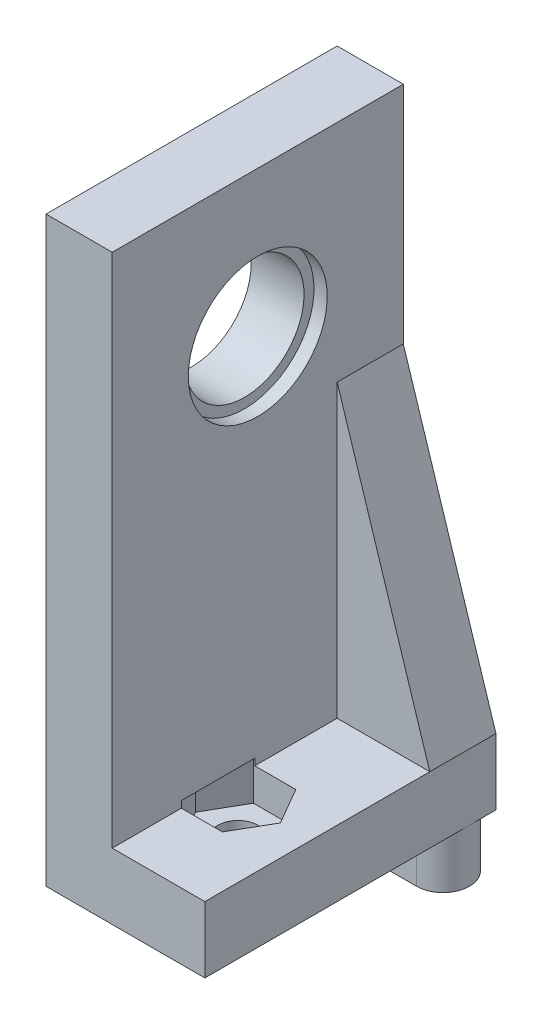
ISO-10303-21;
HEADER;
FILE_DESCRIPTION(('STEP AP214'),'2;1');
FILE_NAME('part.step','',(''),(''),'','','');
FILE_SCHEMA(('AUTOMOTIVE_DESIGN { 1 0 10303 214 1 1 1 1 }'));
ENDSEC;
DATA;
#1=APPLICATION_CONTEXT('core data for automotive mechanical design processes');
#2=APPLICATION_PROTOCOL_DEFINITION('international standard','automotive_design',2000,#1);
#3=PRODUCT_CONTEXT('',#1,'mechanical');
#4=PRODUCT('Part','Part','',(#3));
#5=PRODUCT_RELATED_PRODUCT_CATEGORY('part','',(#4));
#6=PRODUCT_DEFINITION_FORMATION('','',#4);
#7=PRODUCT_DEFINITION_CONTEXT('part definition',#1,'design');
#8=PRODUCT_DEFINITION('design','',#6,#7);
#9=PRODUCT_DEFINITION_SHAPE('','',#8);
#10=(LENGTH_UNIT() NAMED_UNIT(*) SI_UNIT(.MILLI.,.METRE.));
#11=(NAMED_UNIT(*) PLANE_ANGLE_UNIT() SI_UNIT($,.RADIAN.));
#12=(NAMED_UNIT(*) SI_UNIT($,.STERADIAN.) SOLID_ANGLE_UNIT());
#13=UNCERTAINTY_MEASURE_WITH_UNIT(LENGTH_MEASURE(1.E-05),#10,'distance_accuracy_value','');
#14=(GEOMETRIC_REPRESENTATION_CONTEXT(3) GLOBAL_UNCERTAINTY_ASSIGNED_CONTEXT((#13)) GLOBAL_UNIT_ASSIGNED_CONTEXT((#10,
#11,#12)) REPRESENTATION_CONTEXT('',''));
#15=CARTESIAN_POINT('',(0.,0.,0.));
#16=DIRECTION('',(0.,0.,1.));
#17=DIRECTION('',(1.,0.,0.));
#18=AXIS2_PLACEMENT_3D('',#15,#16,#17);
#19=CARTESIAN_POINT('',(5.,-27.,11.));
#20=DIRECTION('',(1.,0.,0.));
#21=DIRECTION('',(0.,0.,-1.));
#22=AXIS2_PLACEMENT_3D('',#19,#20,#21);
#23=PLANE('',#22);
#24=DIRECTION('',(0.,0.,-1.));
#25=VECTOR('',#24,1.);
#26=CARTESIAN_POINT('',(5.,0.,-24.));
#27=LINE('',#26,#25);
#28=CARTESIAN_POINT('',(5.,0.,-24.));
#29=VERTEX_POINT('',#28);
#30=CARTESIAN_POINT('',(5.,0.,-29.));
#31=VERTEX_POINT('',#30);
#32=EDGE_CURVE('E166',#29,#31,#27,.T.);
#33=ORIENTED_EDGE('',*,*,#32,.T.);
#34=DIRECTION('',(0.,1.,0.));
#35=VECTOR('',#34,1.);
#36=CARTESIAN_POINT('',(5.,17.,-29.));
#37=LINE('',#36,#35);
#38=CARTESIAN_POINT('',(5.,17.,-29.));
#39=VERTEX_POINT('',#38);
#40=EDGE_CURVE('E309',#31,#39,#37,.T.);
#41=ORIENTED_EDGE('',*,*,#40,.T.);
#42=DIRECTION('',(0.,0.,1.));
#43=VECTOR('',#42,1.);
#44=CARTESIAN_POINT('',(5.,17.,11.));
#45=LINE('',#44,#43);
#46=CARTESIAN_POINT('',(5.,17.,-7.));
#47=VERTEX_POINT('',#46);
#48=EDGE_CURVE('E305',#39,#47,#45,.T.);
#49=ORIENTED_EDGE('',*,*,#48,.T.);
#50=DIRECTION('',(0.,1.,0.));
#51=VECTOR('',#50,1.);
#52=CARTESIAN_POINT('',(5.,17.,-7.));
#53=LINE('',#52,#51);
#54=CARTESIAN_POINT('',(5.,-22.,-7.00000000000001));
#55=VERTEX_POINT('',#54);
#56=EDGE_CURVE('E285',#55,#47,#53,.T.);
#57=ORIENTED_EDGE('',*,*,#56,.F.);
#58=DIRECTION('',(0.,0.,1.));
#59=VECTOR('',#58,1.);
#60=CARTESIAN_POINT('',(5.,-22.,-7.00000000000001));
#61=LINE('',#60,#59);
#62=CARTESIAN_POINT('',(5.,-22.,-12.225));
#63=VERTEX_POINT('',#62);
#64=EDGE_CURVE('E261',#63,#55,#61,.T.);
#65=ORIENTED_EDGE('',*,*,#64,.F.);
#66=DIRECTION('',(0.,1.,0.));
#67=VECTOR('',#66,1.);
#68=CARTESIAN_POINT('',(5.,-27.,-12.225));
#69=LINE('',#68,#67);
#70=CARTESIAN_POINT('',(5.,-21.5,-12.225));
#71=VERTEX_POINT('',#70);
#72=EDGE_CURVE('E58',#63,#71,#69,.T.);
#73=ORIENTED_EDGE('',*,*,#72,.T.);
#74=DIRECTION('',(0.,0.,1.));
#75=VECTOR('',#74,1.);
#76=CARTESIAN_POINT('',(5.,-21.5,11.));
#77=LINE('',#76,#75);
#78=CARTESIAN_POINT('',(5.,-21.5,-17.775));
#79=VERTEX_POINT('',#78);
#80=EDGE_CURVE('E11',#79,#71,#77,.T.);
#81=ORIENTED_EDGE('',*,*,#80,.F.);
#82=DIRECTION('',(0.,-1.,0.));
#83=VECTOR('',#82,1.);
#84=CARTESIAN_POINT('',(5.,-27.,-17.775));
#85=LINE('',#84,#83);
#86=CARTESIAN_POINT('',(5.,-22.,-17.775));
#87=VERTEX_POINT('',#86);
#88=EDGE_CURVE('E226',#79,#87,#85,.T.);
#89=ORIENTED_EDGE('',*,*,#88,.T.);
#90=CARTESIAN_POINT('',(5.,-22.,-24.));
#91=VERTEX_POINT('',#90);
#92=EDGE_CURVE('E36',#91,#87,#61,.T.);
#93=ORIENTED_EDGE('',*,*,#92,.F.);
#94=DIRECTION('',(0.,1.,0.));
#95=VECTOR('',#94,1.);
#96=CARTESIAN_POINT('',(5.,0.,-24.));
#97=LINE('',#96,#95);
#98=EDGE_CURVE('E178',#91,#29,#97,.T.);
#99=ORIENTED_EDGE('',*,*,#98,.T.);
#100=EDGE_LOOP('',(#33,#41,#49,#57,#65,#73,#81,#89,#93,#99));
#101=FACE_BOUND('',#100,.T.);
#102=CARTESIAN_POINT('',(5.,6.,-18.));
#103=DIRECTION('',(-1.,0.,0.));
#104=DIRECTION('',(0.,0.,1.));
#105=AXIS2_PLACEMENT_3D('',#102,#103,#104);
#106=CIRCLE('',#105,5.25);
#107=CARTESIAN_POINT('',(5.,6.,-12.75));
#108=VERTEX_POINT('',#107);
#109=EDGE_CURVE('E388',#108,#108,#106,.T.);
#110=ORIENTED_EDGE('',*,*,#109,.T.);
#111=EDGE_LOOP('',(#110));
#112=FACE_BOUND('',#111,.T.);
#113=ADVANCED_FACE('F32',(#101,#112),#23,.T.);
#114=CARTESIAN_POINT('',(12.,-22.,-7.00000000000001));
#115=DIRECTION('',(0.,-1.,0.));
#116=DIRECTION('',(0.,0.,-1.));
#117=AXIS2_PLACEMENT_3D('',#114,#115,#116);
#118=PLANE('',#117);
#119=DIRECTION('',(0.,0.,1.));
#120=VECTOR('',#119,1.);
#121=CARTESIAN_POINT('',(12.,-22.,-7.00000000000001));
#122=LINE('',#121,#120);
#123=CARTESIAN_POINT('',(12.,-22.,-24.));
#124=VERTEX_POINT('',#123);
#125=CARTESIAN_POINT('',(12.,-22.,-7.00000000000001));
#126=VERTEX_POINT('',#125);
#127=EDGE_CURVE('E362',#124,#126,#122,.T.);
#128=ORIENTED_EDGE('',*,*,#127,.F.);
#129=DIRECTION('',(-1.,0.,0.));
#130=VECTOR('',#129,1.);
#131=CARTESIAN_POINT('',(5.,-22.,-24.));
#132=LINE('',#131,#130);
#133=EDGE_CURVE('E50',#124,#91,#132,.T.);
#134=ORIENTED_EDGE('',*,*,#133,.T.);
#135=ORIENTED_EDGE('',*,*,#92,.T.);
#136=DIRECTION('',(-1.,0.,0.));
#137=VECTOR('',#136,1.);
#138=CARTESIAN_POINT('',(12.,-22.,-17.775));
#139=LINE('',#138,#137);
#140=CARTESIAN_POINT('',(8.10214699700121,-22.,-17.775));
#141=VERTEX_POINT('',#140);
#142=EDGE_CURVE('E42',#141,#87,#139,.T.);
#143=ORIENTED_EDGE('',*,*,#142,.F.);
#144=DIRECTION('',(-0.5,0.,-0.866025403784438));
#145=VECTOR('',#144,1.);
#146=CARTESIAN_POINT('',(13.7423221106396,-22.,-8.0059301395928));
#147=LINE('',#146,#145);
#148=CARTESIAN_POINT('',(9.70429399400242,-22.,-15.));
#149=VERTEX_POINT('',#148);
#150=EDGE_CURVE('E322',#149,#141,#147,.T.);
#151=ORIENTED_EDGE('',*,*,#150,.F.);
#152=DIRECTION('',(0.5,0.,-0.866025403784439));
#153=VECTOR('',#152,1.);
#154=CARTESIAN_POINT('',(6.81411888036406,-22.,-9.99406986040722));
#155=LINE('',#154,#153);
#156=CARTESIAN_POINT('',(8.10214699700121,-22.,-12.225));
#157=VERTEX_POINT('',#156);
#158=EDGE_CURVE('E323',#157,#149,#155,.T.);
#159=ORIENTED_EDGE('',*,*,#158,.F.);
#160=DIRECTION('',(1.,0.,0.));
#161=VECTOR('',#160,1.);
#162=CARTESIAN_POINT('',(12.,-22.,-12.225));
#163=LINE('',#162,#161);
#164=EDGE_CURVE('E247',#63,#157,#163,.T.);
#165=ORIENTED_EDGE('',*,*,#164,.F.);
#166=ORIENTED_EDGE('',*,*,#64,.T.);
#167=DIRECTION('',(-1.,0.,0.));
#168=VECTOR('',#167,1.);
#169=CARTESIAN_POINT('',(12.,-22.,-7.00000000000001));
#170=LINE('',#169,#168);
#171=EDGE_CURVE('E293',#126,#55,#170,.T.);
#172=ORIENTED_EDGE('',*,*,#171,.F.);
#173=EDGE_LOOP('',(#128,#134,#135,#143,#151,#159,#165,#166,#172));
#174=FACE_BOUND('',#173,.T.);
#175=ADVANCED_FACE('F335',(#174),#118,.F.);
#176=CARTESIAN_POINT('',(6.5,-22.,-15.));
#177=DIRECTION('',(0.,-1.,0.));
#178=DIRECTION('',(0.,0.,-1.));
#179=AXIS2_PLACEMENT_3D('',#176,#177,#178);
#180=CYLINDRICAL_SURFACE('',#179,1.5);
#181=CARTESIAN_POINT('',(6.5,-27.,-15.));
#182=DIRECTION('',(0.,-1.,0.));
#183=DIRECTION('',(0.,0.,-1.));
#184=AXIS2_PLACEMENT_3D('',#181,#182,#183);
#185=CIRCLE('',#184,1.5);
#186=CARTESIAN_POINT('',(6.5,-27.,-16.5));
#187=VERTEX_POINT('',#186);
#188=EDGE_CURVE('E228',#187,#187,#185,.T.);
#189=ORIENTED_EDGE('',*,*,#188,.T.);
#190=EDGE_LOOP('',(#189));
#191=FACE_BOUND('',#190,.T.);
#192=CARTESIAN_POINT('',(6.5,-24.5,-15.));
#193=DIRECTION('',(0.,1.,0.));
#194=DIRECTION('',(0.,0.,1.));
#195=AXIS2_PLACEMENT_3D('',#192,#193,#194);
#196=CIRCLE('',#195,1.5);
#197=CARTESIAN_POINT('',(6.5,-24.5,-13.5));
#198=VERTEX_POINT('',#197);
#199=EDGE_CURVE('E224',#198,#198,#196,.F.);
#200=ORIENTED_EDGE('',*,*,#199,.F.);
#201=EDGE_LOOP('',(#200));
#202=FACE_BOUND('',#201,.T.);
#203=ADVANCED_FACE('F429',(#191,#202),#180,.F.);
#204=CARTESIAN_POINT('',(5.,-27.,11.));
#205=DIRECTION('',(0.,1.,0.));
#206=DIRECTION('',(0.,0.,1.));
#207=AXIS2_PLACEMENT_3D('',#204,#205,#206);
#208=PLANE('',#207);
#209=ORIENTED_EDGE('',*,*,#188,.F.);
#210=EDGE_LOOP('',(#209));
#211=FACE_BOUND('',#210,.T.);
#212=DIRECTION('',(-1.,0.,0.));
#213=VECTOR('',#212,1.);
#214=CARTESIAN_POINT('',(0.,-27.,-25.));
#215=LINE('',#214,#213);
#216=CARTESIAN_POINT('',(10.,-27.,-25.));
#217=VERTEX_POINT('',#216);
#218=CARTESIAN_POINT('',(0.,-27.,-25.));
#219=VERTEX_POINT('',#218);
#220=EDGE_CURVE('E236',#217,#219,#215,.T.);
#221=ORIENTED_EDGE('',*,*,#220,.F.);
#222=CARTESIAN_POINT('',(10.,-27.,-27.));
#223=DIRECTION('',(0.,-1.,0.));
#224=DIRECTION('',(0.,0.,-1.));
#225=AXIS2_PLACEMENT_3D('',#222,#223,#224);
#226=CIRCLE('',#225,2.);
#227=CARTESIAN_POINT('',(12.,-27.,-27.));
#228=VERTEX_POINT('',#227);
#229=EDGE_CURVE('E243',#228,#217,#226,.T.);
#230=ORIENTED_EDGE('',*,*,#229,.F.);
#231=DIRECTION('',(0.,0.,-1.));
#232=VECTOR('',#231,1.);
#233=CARTESIAN_POINT('',(12.,-27.,-7.00000000000001));
#234=LINE('',#233,#232);
#235=CARTESIAN_POINT('',(12.,-27.,-7.00000000000001));
#236=VERTEX_POINT('',#235);
#237=EDGE_CURVE('E374',#236,#228,#234,.T.);
#238=ORIENTED_EDGE('',*,*,#237,.F.);
#239=DIRECTION('',(1.,0.,0.));
#240=VECTOR('',#239,1.);
#241=CARTESIAN_POINT('',(0.,-27.,-7.00000000000001));
#242=LINE('',#241,#240);
#243=CARTESIAN_POINT('',(0.,-27.,-7.00000000000001));
#244=VERTEX_POINT('',#243);
#245=EDGE_CURVE('E284',#244,#236,#242,.T.);
#246=ORIENTED_EDGE('',*,*,#245,.F.);
#247=DIRECTION('',(0.,0.,-1.));
#248=VECTOR('',#247,1.);
#249=CARTESIAN_POINT('',(0.,-27.,11.));
#250=LINE('',#249,#248);
#251=EDGE_CURVE('E255',#244,#219,#250,.T.);
#252=ORIENTED_EDGE('',*,*,#251,.T.);
#253=EDGE_LOOP('',(#221,#230,#238,#246,#252));
#254=FACE_BOUND('',#253,.T.);
#255=ADVANCED_FACE('F34',(#211,#254),#208,.F.);
#256=CARTESIAN_POINT('',(10.,-27.,-29.));
#257=VERTEX_POINT('',#256);
#258=EDGE_CURVE('E231',#257,#228,#226,.T.);
#259=ORIENTED_EDGE('',*,*,#258,.F.);
#260=DIRECTION('',(-1.,0.,0.));
#261=VECTOR('',#260,1.);
#262=CARTESIAN_POINT('',(5.,-27.,-29.));
#263=LINE('',#262,#261);
#264=CARTESIAN_POINT('',(12.,-27.,-29.));
#265=VERTEX_POINT('',#264);
#266=EDGE_CURVE('E248',#265,#257,#263,.T.);
#267=ORIENTED_EDGE('',*,*,#266,.F.);
#268=EDGE_CURVE('E372',#228,#265,#234,.T.);
#269=ORIENTED_EDGE('',*,*,#268,.F.);
#270=EDGE_LOOP('',(#259,#267,#269));
#271=FACE_BOUND('',#270,.T.);
#272=ADVANCED_FACE('F422',(#271),#208,.F.);
#273=CARTESIAN_POINT('',(0.,-27.,11.));
#274=DIRECTION('',(1.,0.,0.));
#275=DIRECTION('',(0.,0.,-1.));
#276=AXIS2_PLACEMENT_3D('',#273,#274,#275);
#277=PLANE('',#276);
#278=CARTESIAN_POINT('',(0.,6.,-18.));
#279=DIRECTION('',(1.,0.,0.));
#280=DIRECTION('',(0.,0.,-1.));
#281=AXIS2_PLACEMENT_3D('',#278,#279,#280);
#282=CIRCLE('',#281,4.5);
#283=CARTESIAN_POINT('',(0.,6.,-22.5));
#284=VERTEX_POINT('',#283);
#285=EDGE_CURVE('E317',#284,#284,#282,.T.);
#286=ORIENTED_EDGE('',*,*,#285,.T.);
#287=EDGE_LOOP('',(#286));
#288=FACE_BOUND('',#287,.T.);
#289=ORIENTED_EDGE('',*,*,#251,.F.);
#290=DIRECTION('',(0.,1.,0.));
#291=VECTOR('',#290,1.);
#292=CARTESIAN_POINT('',(0.,17.,-7.));
#293=LINE('',#292,#291);
#294=CARTESIAN_POINT('',(0.,17.,-7.));
#295=VERTEX_POINT('',#294);
#296=EDGE_CURVE('E280',#244,#295,#293,.T.);
#297=ORIENTED_EDGE('',*,*,#296,.T.);
#298=DIRECTION('',(0.,0.,1.));
#299=VECTOR('',#298,1.);
#300=CARTESIAN_POINT('',(0.,17.,11.));
#301=LINE('',#300,#299);
#302=CARTESIAN_POINT('',(0.,17.,-29.));
#303=VERTEX_POINT('',#302);
#304=EDGE_CURVE('E306',#303,#295,#301,.T.);
#305=ORIENTED_EDGE('',*,*,#304,.F.);
#306=DIRECTION('',(0.,1.,0.));
#307=VECTOR('',#306,1.);
#308=CARTESIAN_POINT('',(0.,17.,-29.));
#309=LINE('',#308,#307);
#310=CARTESIAN_POINT('',(0.,-31.,-29.));
#311=VERTEX_POINT('',#310);
#312=EDGE_CURVE('E310',#311,#303,#309,.T.);
#313=ORIENTED_EDGE('',*,*,#312,.F.);
#314=DIRECTION('',(0.,0.,-1.));
#315=VECTOR('',#314,1.);
#316=CARTESIAN_POINT('',(0.,-31.,-29.));
#317=LINE('',#316,#315);
#318=CARTESIAN_POINT('',(0.,-31.,-25.));
#319=VERTEX_POINT('',#318);
#320=EDGE_CURVE('E232',#319,#311,#317,.T.);
#321=ORIENTED_EDGE('',*,*,#320,.F.);
#322=DIRECTION('',(0.,1.,0.));
#323=VECTOR('',#322,1.);
#324=CARTESIAN_POINT('',(0.,-31.,-25.));
#325=LINE('',#324,#323);
#326=EDGE_CURVE('E242',#319,#219,#325,.T.);
#327=ORIENTED_EDGE('',*,*,#326,.T.);
#328=EDGE_LOOP('',(#289,#297,#305,#313,#321,#327));
#329=FACE_BOUND('',#328,.T.);
#330=ADVANCED_FACE('F411',(#288,#329),#277,.F.);
#331=CARTESIAN_POINT('',(5.,17.,-29.));
#332=DIRECTION('',(0.,0.,1.));
#333=DIRECTION('',(0.,-1.,0.));
#334=AXIS2_PLACEMENT_3D('',#331,#332,#333);
#335=PLANE('',#334);
#336=ORIENTED_EDGE('',*,*,#40,.F.);
#337=DIRECTION('',(0.303203657276947,-0.952925780013262,0.));
#338=VECTOR('',#337,1.);
#339=CARTESIAN_POINT('',(12.,-22.,-29.));
#340=LINE('',#339,#338);
#341=CARTESIAN_POINT('',(12.,-22.,-29.));
#342=VERTEX_POINT('',#341);
#343=EDGE_CURVE('E171',#31,#342,#340,.T.);
#344=ORIENTED_EDGE('',*,*,#343,.T.);
#345=DIRECTION('',(0.,1.,0.));
#346=VECTOR('',#345,1.);
#347=CARTESIAN_POINT('',(12.,-27.,-29.));
#348=LINE('',#347,#346);
#349=EDGE_CURVE('E376',#265,#342,#348,.T.);
#350=ORIENTED_EDGE('',*,*,#349,.F.);
#351=ORIENTED_EDGE('',*,*,#266,.T.);
#352=DIRECTION('',(0.,1.,0.));
#353=VECTOR('',#352,1.);
#354=CARTESIAN_POINT('',(10.,-31.,-29.));
#355=LINE('',#354,#353);
#356=CARTESIAN_POINT('',(10.,-31.,-29.));
#357=VERTEX_POINT('',#356);
#358=EDGE_CURVE('E258',#357,#257,#355,.T.);
#359=ORIENTED_EDGE('',*,*,#358,.F.);
#360=DIRECTION('',(1.,0.,0.));
#361=VECTOR('',#360,1.);
#362=CARTESIAN_POINT('',(0.,-31.,-29.));
#363=LINE('',#362,#361);
#364=EDGE_CURVE('E235',#311,#357,#363,.T.);
#365=ORIENTED_EDGE('',*,*,#364,.F.);
#366=ORIENTED_EDGE('',*,*,#312,.T.);
#367=DIRECTION('',(-1.,0.,0.));
#368=VECTOR('',#367,1.);
#369=CARTESIAN_POINT('',(5.,17.,-29.));
#370=LINE('',#369,#368);
#371=EDGE_CURVE('E300',#39,#303,#370,.T.);
#372=ORIENTED_EDGE('',*,*,#371,.F.);
#373=EDGE_LOOP('',(#336,#344,#350,#351,#359,#365,#366,#372));
#374=FACE_BOUND('',#373,.T.);
#375=ADVANCED_FACE('F381',(#374),#335,.F.);
#376=CARTESIAN_POINT('',(5.,17.,11.));
#377=DIRECTION('',(0.,-1.,0.));
#378=DIRECTION('',(0.,0.,-1.));
#379=AXIS2_PLACEMENT_3D('',#376,#377,#378);
#380=PLANE('',#379);
#381=ORIENTED_EDGE('',*,*,#304,.T.);
#382=DIRECTION('',(1.,0.,0.));
#383=VECTOR('',#382,1.);
#384=CARTESIAN_POINT('',(0.,17.,-7.));
#385=LINE('',#384,#383);
#386=EDGE_CURVE('E288',#295,#47,#385,.T.);
#387=ORIENTED_EDGE('',*,*,#386,.T.);
#388=ORIENTED_EDGE('',*,*,#48,.F.);
#389=ORIENTED_EDGE('',*,*,#371,.T.);
#390=EDGE_LOOP('',(#381,#387,#388,#389));
#391=FACE_BOUND('',#390,.T.);
#392=ADVANCED_FACE('F386',(#391),#380,.F.);
#393=CARTESIAN_POINT('',(5.,6.,-18.));
#394=DIRECTION('',(-1.,0.,0.));
#395=DIRECTION('',(0.,0.,1.));
#396=AXIS2_PLACEMENT_3D('',#393,#394,#395);
#397=CYLINDRICAL_SURFACE('',#396,4.5);
#398=CARTESIAN_POINT('',(4.,6.,-18.));
#399=DIRECTION('',(-1.,0.,0.));
#400=DIRECTION('',(0.,0.,1.));
#401=AXIS2_PLACEMENT_3D('',#398,#399,#400);
#402=CIRCLE('',#401,4.5);
#403=CARTESIAN_POINT('',(4.,6.,-13.5));
#404=VERTEX_POINT('',#403);
#405=EDGE_CURVE('E294',#404,#404,#402,.T.);
#406=ORIENTED_EDGE('',*,*,#405,.F.);
#407=EDGE_LOOP('',(#406));
#408=FACE_BOUND('',#407,.T.);
#409=ORIENTED_EDGE('',*,*,#285,.F.);
#410=EDGE_LOOP('',(#409));
#411=FACE_BOUND('',#410,.T.);
#412=ADVANCED_FACE('F438',(#408,#411),#397,.F.);
#413=CARTESIAN_POINT('',(4.,6.,-18.));
#414=DIRECTION('',(1.,0.,0.));
#415=DIRECTION('',(0.,0.,-1.));
#416=AXIS2_PLACEMENT_3D('',#413,#414,#415);
#417=CYLINDRICAL_SURFACE('',#416,5.25);
#418=CARTESIAN_POINT('',(4.,6.,-18.));
#419=DIRECTION('',(-1.,0.,0.));
#420=DIRECTION('',(0.,0.,1.));
#421=AXIS2_PLACEMENT_3D('',#418,#419,#420);
#422=CIRCLE('',#421,5.25);
#423=CARTESIAN_POINT('',(4.,6.,-12.75));
#424=VERTEX_POINT('',#423);
#425=EDGE_CURVE('E390',#424,#424,#422,.T.);
#426=ORIENTED_EDGE('',*,*,#425,.T.);
#427=EDGE_LOOP('',(#426));
#428=FACE_BOUND('',#427,.T.);
#429=ORIENTED_EDGE('',*,*,#109,.F.);
#430=EDGE_LOOP('',(#429));
#431=FACE_BOUND('',#430,.T.);
#432=ADVANCED_FACE('F461',(#428,#431),#417,.F.);
#433=CARTESIAN_POINT('',(4.,6.,-18.));
#434=DIRECTION('',(-1.,0.,0.));
#435=DIRECTION('',(0.,0.,1.));
#436=AXIS2_PLACEMENT_3D('',#433,#434,#435);
#437=PLANE('',#436);
#438=ORIENTED_EDGE('',*,*,#405,.T.);
#439=EDGE_LOOP('',(#438));
#440=FACE_BOUND('',#439,.T.);
#441=ORIENTED_EDGE('',*,*,#425,.F.);
#442=EDGE_LOOP('',(#441));
#443=FACE_BOUND('',#442,.T.);
#444=ADVANCED_FACE('F468',(#440,#443),#437,.F.);
#445=CARTESIAN_POINT('',(0.,17.,-7.));
#446=DIRECTION('',(0.,0.,-1.));
#447=DIRECTION('',(0.,1.,0.));
#448=AXIS2_PLACEMENT_3D('',#445,#446,#447);
#449=PLANE('',#448);
#450=ORIENTED_EDGE('',*,*,#245,.T.);
#451=DIRECTION('',(0.,-1.,0.));
#452=VECTOR('',#451,1.);
#453=CARTESIAN_POINT('',(12.,-27.,-7.00000000000001));
#454=LINE('',#453,#452);
#455=EDGE_CURVE('E366',#126,#236,#454,.T.);
#456=ORIENTED_EDGE('',*,*,#455,.F.);
#457=ORIENTED_EDGE('',*,*,#171,.T.);
#458=ORIENTED_EDGE('',*,*,#56,.T.);
#459=ORIENTED_EDGE('',*,*,#386,.F.);
#460=ORIENTED_EDGE('',*,*,#296,.F.);
#461=EDGE_LOOP('',(#450,#456,#457,#458,#459,#460));
#462=FACE_BOUND('',#461,.T.);
#463=ADVANCED_FACE('F367',(#462),#449,.F.);
#464=CARTESIAN_POINT('',(12.,-22.,-7.00000000000001));
#465=DIRECTION('',(-1.,0.,0.));
#466=DIRECTION('',(0.,0.,1.));
#467=AXIS2_PLACEMENT_3D('',#464,#465,#466);
#468=PLANE('',#467);
#469=ORIENTED_EDGE('',*,*,#455,.T.);
#470=ORIENTED_EDGE('',*,*,#237,.T.);
#471=ORIENTED_EDGE('',*,*,#268,.T.);
#472=ORIENTED_EDGE('',*,*,#349,.T.);
#473=EDGE_CURVE('E278',#342,#124,#122,.T.);
#474=ORIENTED_EDGE('',*,*,#473,.T.);
#475=ORIENTED_EDGE('',*,*,#127,.T.);
#476=EDGE_LOOP('',(#469,#470,#471,#472,#474,#475));
#477=FACE_BOUND('',#476,.T.);
#478=ADVANCED_FACE('F379',(#477),#468,.F.);
#479=CARTESIAN_POINT('',(10.,-31.,-27.));
#480=DIRECTION('',(0.,1.,0.));
#481=DIRECTION('',(0.,0.,1.));
#482=AXIS2_PLACEMENT_3D('',#479,#480,#481);
#483=CYLINDRICAL_SURFACE('',#482,2.);
#484=ORIENTED_EDGE('',*,*,#258,.T.);
#485=ORIENTED_EDGE('',*,*,#229,.T.);
#486=DIRECTION('',(0.,1.,0.));
#487=VECTOR('',#486,1.);
#488=CARTESIAN_POINT('',(10.,-31.,-25.));
#489=LINE('',#488,#487);
#490=CARTESIAN_POINT('',(10.,-31.,-25.));
#491=VERTEX_POINT('',#490);
#492=EDGE_CURVE('E262',#491,#217,#489,.T.);
#493=ORIENTED_EDGE('',*,*,#492,.F.);
#494=CARTESIAN_POINT('',(10.,-31.,-27.));
#495=DIRECTION('',(0.,-1.,0.));
#496=DIRECTION('',(0.,0.,-1.));
#497=AXIS2_PLACEMENT_3D('',#494,#495,#496);
#498=CIRCLE('',#497,2.);
#499=EDGE_CURVE('E238',#357,#491,#498,.T.);
#500=ORIENTED_EDGE('',*,*,#499,.F.);
#501=ORIENTED_EDGE('',*,*,#358,.T.);
#502=EDGE_LOOP('',(#484,#485,#493,#500,#501));
#503=FACE_BOUND('',#502,.T.);
#504=ADVANCED_FACE('F418',(#503),#483,.T.);
#505=CARTESIAN_POINT('',(0.,-31.,-25.));
#506=DIRECTION('',(0.,0.,-1.));
#507=DIRECTION('',(-1.,0.,0.));
#508=AXIS2_PLACEMENT_3D('',#505,#506,#507);
#509=PLANE('',#508);
#510=ORIENTED_EDGE('',*,*,#220,.T.);
#511=ORIENTED_EDGE('',*,*,#326,.F.);
#512=DIRECTION('',(-1.,0.,0.));
#513=VECTOR('',#512,1.);
#514=CARTESIAN_POINT('',(0.,-31.,-25.));
#515=LINE('',#514,#513);
#516=EDGE_CURVE('E240',#491,#319,#515,.T.);
#517=ORIENTED_EDGE('',*,*,#516,.F.);
#518=ORIENTED_EDGE('',*,*,#492,.T.);
#519=EDGE_LOOP('',(#510,#511,#517,#518));
#520=FACE_BOUND('',#519,.T.);
#521=ADVANCED_FACE('F407',(#520),#509,.F.);
#522=CARTESIAN_POINT('',(10.,-31.,-27.));
#523=DIRECTION('',(0.,-1.,0.));
#524=DIRECTION('',(0.,0.,-1.));
#525=AXIS2_PLACEMENT_3D('',#522,#523,#524);
#526=PLANE('',#525);
#527=ORIENTED_EDGE('',*,*,#320,.T.);
#528=ORIENTED_EDGE('',*,*,#364,.T.);
#529=ORIENTED_EDGE('',*,*,#499,.T.);
#530=ORIENTED_EDGE('',*,*,#516,.T.);
#531=EDGE_LOOP('',(#527,#528,#529,#530));
#532=FACE_BOUND('',#531,.T.);
#533=ADVANCED_FACE('F414',(#532),#526,.T.);
#534=CARTESIAN_POINT('',(8.10214699700121,-21.5,-12.225));
#535=DIRECTION('',(-0.866025403784439,0.,-0.5));
#536=DIRECTION('',(-0.5,0.,0.866025403784439));
#537=AXIS2_PLACEMENT_3D('',#534,#535,#536);
#538=PLANE('',#537);
#539=ORIENTED_EDGE('',*,*,#158,.T.);
#540=DIRECTION('',(0.,-1.,0.));
#541=VECTOR('',#540,1.);
#542=CARTESIAN_POINT('',(9.70429399400242,-21.5,-15.));
#543=LINE('',#542,#541);
#544=CARTESIAN_POINT('',(9.70429399400242,-24.5,-15.));
#545=VERTEX_POINT('',#544);
#546=EDGE_CURVE('E222',#149,#545,#543,.T.);
#547=ORIENTED_EDGE('',*,*,#546,.T.);
#548=DIRECTION('',(0.5,0.,-0.866025403784439));
#549=VECTOR('',#548,1.);
#550=CARTESIAN_POINT('',(8.10214699700121,-24.5,-12.225));
#551=LINE('',#550,#549);
#552=CARTESIAN_POINT('',(8.10214699700121,-24.5,-12.225));
#553=VERTEX_POINT('',#552);
#554=EDGE_CURVE('E175',#553,#545,#551,.T.);
#555=ORIENTED_EDGE('',*,*,#554,.F.);
#556=DIRECTION('',(0.,-1.,0.));
#557=VECTOR('',#556,1.);
#558=CARTESIAN_POINT('',(8.10214699700121,-21.5,-12.225));
#559=LINE('',#558,#557);
#560=EDGE_CURVE('E212',#157,#553,#559,.T.);
#561=ORIENTED_EDGE('',*,*,#560,.F.);
#562=EDGE_LOOP('',(#539,#547,#555,#561));
#563=FACE_BOUND('',#562,.T.);
#564=ADVANCED_FACE('F333',(#563),#538,.T.);
#565=CARTESIAN_POINT('',(9.70429399400242,-21.5,-15.));
#566=DIRECTION('',(-0.866025403784439,0.,0.5));
#567=DIRECTION('',(0.5,0.,0.866025403784438));
#568=AXIS2_PLACEMENT_3D('',#565,#566,#567);
#569=PLANE('',#568);
#570=ORIENTED_EDGE('',*,*,#150,.T.);
#571=DIRECTION('',(0.,-1.,0.));
#572=VECTOR('',#571,1.);
#573=CARTESIAN_POINT('',(8.10214699700121,-21.5,-17.775));
#574=LINE('',#573,#572);
#575=CARTESIAN_POINT('',(8.10214699700121,-24.5,-17.775));
#576=VERTEX_POINT('',#575);
#577=EDGE_CURVE('E220',#141,#576,#574,.T.);
#578=ORIENTED_EDGE('',*,*,#577,.T.);
#579=DIRECTION('',(-0.5,0.,-0.866025403784438));
#580=VECTOR('',#579,1.);
#581=CARTESIAN_POINT('',(9.70429399400242,-24.5,-15.));
#582=LINE('',#581,#580);
#583=EDGE_CURVE('E189',#545,#576,#582,.T.);
#584=ORIENTED_EDGE('',*,*,#583,.F.);
#585=ORIENTED_EDGE('',*,*,#546,.F.);
#586=EDGE_LOOP('',(#570,#578,#584,#585));
#587=FACE_BOUND('',#586,.T.);
#588=ADVANCED_FACE('F339',(#587),#569,.T.);
#589=CARTESIAN_POINT('',(9.70429399400242,-24.5,-15.));
#590=DIRECTION('',(0.,1.,0.));
#591=DIRECTION('',(0.,0.,1.));
#592=AXIS2_PLACEMENT_3D('',#589,#590,#591);
#593=PLANE('',#592);
#594=ORIENTED_EDGE('',*,*,#554,.T.);
#595=ORIENTED_EDGE('',*,*,#583,.T.);
#596=DIRECTION('',(-1.,0.,0.));
#597=VECTOR('',#596,1.);
#598=CARTESIAN_POINT('',(8.10214699700121,-24.5,-17.775));
#599=LINE('',#598,#597);
#600=CARTESIAN_POINT('',(4.89785300299879,-24.5,-17.775));
#601=VERTEX_POINT('',#600);
#602=EDGE_CURVE('E192',#576,#601,#599,.T.);
#603=ORIENTED_EDGE('',*,*,#602,.T.);
#604=DIRECTION('',(-0.5,0.,0.866025403784438));
#605=VECTOR('',#604,1.);
#606=CARTESIAN_POINT('',(4.89785300299879,-24.5,-17.775));
#607=LINE('',#606,#605);
#608=CARTESIAN_POINT('',(3.29570600599757,-24.5,-15.));
#609=VERTEX_POINT('',#608);
#610=EDGE_CURVE('E195',#601,#609,#607,.T.);
#611=ORIENTED_EDGE('',*,*,#610,.T.);
#612=DIRECTION('',(0.5,0.,0.866025403784439));
#613=VECTOR('',#612,1.);
#614=CARTESIAN_POINT('',(3.29570600599757,-24.5,-15.));
#615=LINE('',#614,#613);
#616=CARTESIAN_POINT('',(4.89785300299879,-24.5,-12.225));
#617=VERTEX_POINT('',#616);
#618=EDGE_CURVE('E198',#609,#617,#615,.T.);
#619=ORIENTED_EDGE('',*,*,#618,.T.);
#620=DIRECTION('',(1.,0.,0.));
#621=VECTOR('',#620,1.);
#622=CARTESIAN_POINT('',(4.89785300299879,-24.5,-12.225));
#623=LINE('',#622,#621);
#624=EDGE_CURVE('E201',#617,#553,#623,.T.);
#625=ORIENTED_EDGE('',*,*,#624,.T.);
#626=EDGE_LOOP('',(#594,#595,#603,#611,#619,#625));
#627=FACE_BOUND('',#626,.T.);
#628=ORIENTED_EDGE('',*,*,#199,.T.);
#629=EDGE_LOOP('',(#628));
#630=FACE_BOUND('',#629,.T.);
#631=ADVANCED_FACE('F347',(#627,#630),#593,.T.);
#632=CARTESIAN_POINT('',(8.10214699700121,-21.5,-17.775));
#633=DIRECTION('',(0.,0.,1.));
#634=DIRECTION('',(1.,0.,0.));
#635=AXIS2_PLACEMENT_3D('',#632,#633,#634);
#636=PLANE('',#635);
#637=DIRECTION('',(-1.,0.,0.));
#638=VECTOR('',#637,1.);
#639=CARTESIAN_POINT('',(8.10214699700121,-21.5,-17.775));
#640=LINE('',#639,#638);
#641=CARTESIAN_POINT('',(4.89785300299879,-21.5,-17.775));
#642=VERTEX_POINT('',#641);
#643=EDGE_CURVE('E204',#79,#642,#640,.T.);
#644=ORIENTED_EDGE('',*,*,#643,.T.);
#645=DIRECTION('',(0.,-1.,0.));
#646=VECTOR('',#645,1.);
#647=CARTESIAN_POINT('',(4.89785300299879,-21.5,-17.775));
#648=LINE('',#647,#646);
#649=EDGE_CURVE('E218',#642,#601,#648,.T.);
#650=ORIENTED_EDGE('',*,*,#649,.T.);
#651=ORIENTED_EDGE('',*,*,#602,.F.);
#652=ORIENTED_EDGE('',*,*,#577,.F.);
#653=ORIENTED_EDGE('',*,*,#142,.T.);
#654=ORIENTED_EDGE('',*,*,#88,.F.);
#655=EDGE_LOOP('',(#644,#650,#651,#652,#653,#654));
#656=FACE_BOUND('',#655,.T.);
#657=ADVANCED_FACE('F343',(#656),#636,.T.);
#658=CARTESIAN_POINT('',(4.89785300299879,-21.5,-17.775));
#659=DIRECTION('',(0.866025403784439,0.,0.5));
#660=DIRECTION('',(0.5,0.,-0.866025403784439));
#661=AXIS2_PLACEMENT_3D('',#658,#659,#660);
#662=PLANE('',#661);
#663=ORIENTED_EDGE('',*,*,#649,.F.);
#664=DIRECTION('',(-0.5,0.,0.866025403784438));
#665=VECTOR('',#664,1.);
#666=CARTESIAN_POINT('',(4.89785300299879,-21.5,-17.775));
#667=LINE('',#666,#665);
#668=CARTESIAN_POINT('',(3.29570600599757,-21.5,-15.));
#669=VERTEX_POINT('',#668);
#670=EDGE_CURVE('E206',#642,#669,#667,.T.);
#671=ORIENTED_EDGE('',*,*,#670,.T.);
#672=DIRECTION('',(0.,-1.,0.));
#673=VECTOR('',#672,1.);
#674=CARTESIAN_POINT('',(3.29570600599757,-21.5,-15.));
#675=LINE('',#674,#673);
#676=EDGE_CURVE('E216',#669,#609,#675,.T.);
#677=ORIENTED_EDGE('',*,*,#676,.T.);
#678=ORIENTED_EDGE('',*,*,#610,.F.);
#679=EDGE_LOOP('',(#663,#671,#677,#678));
#680=FACE_BOUND('',#679,.T.);
#681=ADVANCED_FACE('F528',(#680),#662,.T.);
#682=CARTESIAN_POINT('',(3.29570600599757,-21.5,-15.));
#683=DIRECTION('',(0.866025403784439,0.,-0.5));
#684=DIRECTION('',(-0.5,0.,-0.866025403784439));
#685=AXIS2_PLACEMENT_3D('',#682,#683,#684);
#686=PLANE('',#685);
#687=ORIENTED_EDGE('',*,*,#676,.F.);
#688=DIRECTION('',(0.5,0.,0.866025403784439));
#689=VECTOR('',#688,1.);
#690=CARTESIAN_POINT('',(3.29570600599757,-21.5,-15.));
#691=LINE('',#690,#689);
#692=CARTESIAN_POINT('',(4.89785300299879,-21.5,-12.225));
#693=VERTEX_POINT('',#692);
#694=EDGE_CURVE('E208',#669,#693,#691,.T.);
#695=ORIENTED_EDGE('',*,*,#694,.T.);
#696=DIRECTION('',(0.,-1.,0.));
#697=VECTOR('',#696,1.);
#698=CARTESIAN_POINT('',(4.89785300299879,-21.5,-12.225));
#699=LINE('',#698,#697);
#700=EDGE_CURVE('E214',#693,#617,#699,.T.);
#701=ORIENTED_EDGE('',*,*,#700,.T.);
#702=ORIENTED_EDGE('',*,*,#618,.F.);
#703=EDGE_LOOP('',(#687,#695,#701,#702));
#704=FACE_BOUND('',#703,.T.);
#705=ADVANCED_FACE('F535',(#704),#686,.T.);
#706=CARTESIAN_POINT('',(4.89785300299879,-21.5,-12.225));
#707=DIRECTION('',(0.,0.,-1.));
#708=DIRECTION('',(-1.,0.,0.));
#709=AXIS2_PLACEMENT_3D('',#706,#707,#708);
#710=PLANE('',#709);
#711=ORIENTED_EDGE('',*,*,#164,.T.);
#712=ORIENTED_EDGE('',*,*,#560,.T.);
#713=ORIENTED_EDGE('',*,*,#624,.F.);
#714=ORIENTED_EDGE('',*,*,#700,.F.);
#715=DIRECTION('',(1.,0.,0.));
#716=VECTOR('',#715,1.);
#717=CARTESIAN_POINT('',(4.89785300299879,-21.5,-12.225));
#718=LINE('',#717,#716);
#719=EDGE_CURVE('E210',#693,#71,#718,.T.);
#720=ORIENTED_EDGE('',*,*,#719,.T.);
#721=ORIENTED_EDGE('',*,*,#72,.F.);
#722=EDGE_LOOP('',(#711,#712,#713,#714,#720,#721));
#723=FACE_BOUND('',#722,.T.);
#724=ADVANCED_FACE('F328',(#723),#710,.T.);
#725=CARTESIAN_POINT('',(9.70429399400242,-21.5,-15.));
#726=DIRECTION('',(0.,1.,0.));
#727=DIRECTION('',(0.,0.,1.));
#728=AXIS2_PLACEMENT_3D('',#725,#726,#727);
#729=PLANE('',#728);
#730=ORIENTED_EDGE('',*,*,#80,.T.);
#731=ORIENTED_EDGE('',*,*,#719,.F.);
#732=ORIENTED_EDGE('',*,*,#694,.F.);
#733=ORIENTED_EDGE('',*,*,#670,.F.);
#734=ORIENTED_EDGE('',*,*,#643,.F.);
#735=EDGE_LOOP('',(#730,#731,#732,#733,#734));
#736=FACE_BOUND('',#735,.T.);
#737=ADVANCED_FACE('F355',(#736),#729,.F.);
#738=CARTESIAN_POINT('',(12.,-22.,-24.));
#739=DIRECTION('',(0.952925780013262,0.303203657276947,0.));
#740=DIRECTION('',(-0.303203657276947,0.952925780013262,0.));
#741=AXIS2_PLACEMENT_3D('',#738,#739,#740);
#742=PLANE('',#741);
#743=ORIENTED_EDGE('',*,*,#343,.F.);
#744=ORIENTED_EDGE('',*,*,#32,.F.);
#745=DIRECTION('',(0.303203657276947,-0.952925780013262,0.));
#746=VECTOR('',#745,1.);
#747=CARTESIAN_POINT('',(12.,-22.,-24.));
#748=LINE('',#747,#746);
#749=EDGE_CURVE('E168',#29,#124,#748,.T.);
#750=ORIENTED_EDGE('',*,*,#749,.T.);
#751=ORIENTED_EDGE('',*,*,#473,.F.);
#752=EDGE_LOOP('',(#743,#744,#750,#751));
#753=FACE_BOUND('',#752,.T.);
#754=ADVANCED_FACE('F167',(#753),#742,.T.);
#755=CARTESIAN_POINT('',(5.,-22.,-24.));
#756=DIRECTION('',(0.,0.,1.));
#757=DIRECTION('',(0.,-1.,0.));
#758=AXIS2_PLACEMENT_3D('',#755,#756,#757);
#759=PLANE('',#758);
#760=ORIENTED_EDGE('',*,*,#98,.F.);
#761=ORIENTED_EDGE('',*,*,#133,.F.);
#762=ORIENTED_EDGE('',*,*,#749,.F.);
#763=EDGE_LOOP('',(#760,#761,#762));
#764=FACE_BOUND('',#763,.T.);
#765=ADVANCED_FACE('F177',(#764),#759,.T.);
#766=CLOSED_SHELL('',(#113,#175,#203,#255,#272,#330,#375,#392,#412,#432,#444,#463,#478,#504,
#521,#533,#564,#588,#631,#657,#681,#705,#724,#737,#754,#765));
#767=MANIFOLD_SOLID_BREP('B2',#766);
#768=ADVANCED_BREP_SHAPE_REPRESENTATION('',(#18,#767),#14);
#769=SHAPE_DEFINITION_REPRESENTATION(#9,#768);
ENDSEC;
END-ISO-10303-21;
